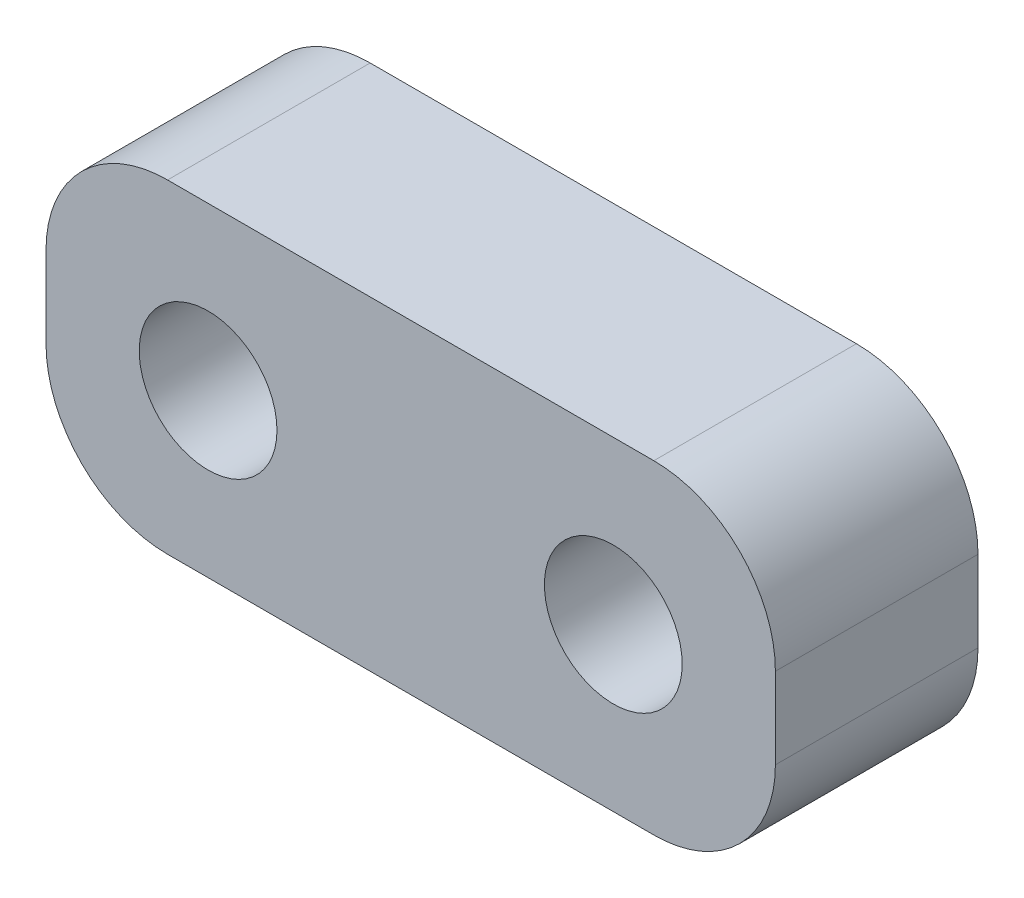
ISO-10303-21;
HEADER;
FILE_DESCRIPTION(('STEP AP214'),'2;1');
FILE_NAME('part.step','',(''),(''),'','','');
FILE_SCHEMA(('AUTOMOTIVE_DESIGN { 1 0 10303 214 1 1 1 1 }'));
ENDSEC;
DATA;
#1=APPLICATION_CONTEXT('core data for automotive mechanical design processes');
#2=APPLICATION_PROTOCOL_DEFINITION('international standard','automotive_design',2000,#1);
#3=PRODUCT_CONTEXT('',#1,'mechanical');
#4=PRODUCT('Part','Part','',(#3));
#5=PRODUCT_RELATED_PRODUCT_CATEGORY('part','',(#4));
#6=PRODUCT_DEFINITION_FORMATION('','',#4);
#7=PRODUCT_DEFINITION_CONTEXT('part definition',#1,'design');
#8=PRODUCT_DEFINITION('design','',#6,#7);
#9=PRODUCT_DEFINITION_SHAPE('','',#8);
#10=(LENGTH_UNIT() NAMED_UNIT(*) SI_UNIT(.MILLI.,.METRE.));
#11=(NAMED_UNIT(*) PLANE_ANGLE_UNIT() SI_UNIT($,.RADIAN.));
#12=(NAMED_UNIT(*) SI_UNIT($,.STERADIAN.) SOLID_ANGLE_UNIT());
#13=UNCERTAINTY_MEASURE_WITH_UNIT(LENGTH_MEASURE(1.E-05),#10,'distance_accuracy_value','');
#14=(GEOMETRIC_REPRESENTATION_CONTEXT(3) GLOBAL_UNCERTAINTY_ASSIGNED_CONTEXT((#13)) GLOBAL_UNIT_ASSIGNED_CONTEXT((#10,
#11,#12)) REPRESENTATION_CONTEXT('',''));
#15=CARTESIAN_POINT('',(0.,0.,0.));
#16=DIRECTION('',(0.,0.,1.));
#17=DIRECTION('',(1.,0.,0.));
#18=AXIS2_PLACEMENT_3D('',#15,#16,#17);
#19=CARTESIAN_POINT('',(9.00000000000001,4.,2.5));
#20=DIRECTION('',(-1.,0.,0.));
#21=DIRECTION('',(0.,-1.,0.));
#22=AXIS2_PLACEMENT_3D('',#19,#20,#21);
#23=PLANE('',#22);
#24=DIRECTION('',(0.,1.,0.));
#25=VECTOR('',#24,1.);
#26=CARTESIAN_POINT('',(9.00000000000001,4.,2.5));
#27=LINE('',#26,#25);
#28=CARTESIAN_POINT('',(9.,-1.,2.5));
#29=VERTEX_POINT('',#28);
#30=CARTESIAN_POINT('',(9.,0.999999999999998,2.5));
#31=VERTEX_POINT('',#30);
#32=EDGE_CURVE('E134',#29,#31,#27,.T.);
#33=ORIENTED_EDGE('',*,*,#32,.F.);
#34=DIRECTION('',(0.,0.,-1.));
#35=VECTOR('',#34,1.);
#36=CARTESIAN_POINT('',(9.,-1.,2.5));
#37=LINE('',#36,#35);
#38=CARTESIAN_POINT('',(9.,-1.,-2.5));
#39=VERTEX_POINT('',#38);
#40=EDGE_CURVE('E11',#29,#39,#37,.T.);
#41=ORIENTED_EDGE('',*,*,#40,.T.);
#42=DIRECTION('',(0.,1.,0.));
#43=VECTOR('',#42,1.);
#44=CARTESIAN_POINT('',(9.00000000000001,4.,-2.5));
#45=LINE('',#44,#43);
#46=CARTESIAN_POINT('',(9.,0.999999999999998,-2.5));
#47=VERTEX_POINT('',#46);
#48=EDGE_CURVE('E136',#39,#47,#45,.T.);
#49=ORIENTED_EDGE('',*,*,#48,.T.);
#50=DIRECTION('',(0.,0.,-1.));
#51=VECTOR('',#50,1.);
#52=CARTESIAN_POINT('',(9.,0.999999999999998,2.5));
#53=LINE('',#52,#51);
#54=EDGE_CURVE('E47',#47,#31,#53,.F.);
#55=ORIENTED_EDGE('',*,*,#54,.T.);
#56=EDGE_LOOP('',(#33,#41,#49,#55));
#57=FACE_BOUND('',#56,.T.);
#58=ADVANCED_FACE('F39',(#57),#23,.F.);
#59=CARTESIAN_POINT('',(-8.99999999999999,4.,2.5));
#60=DIRECTION('',(0.,-1.,0.));
#61=DIRECTION('',(0.,0.,-1.));
#62=AXIS2_PLACEMENT_3D('',#59,#60,#61);
#63=PLANE('',#62);
#64=DIRECTION('',(-1.,0.,0.));
#65=VECTOR('',#64,1.);
#66=CARTESIAN_POINT('',(-8.99999999999999,4.,-2.5));
#67=LINE('',#66,#65);
#68=CARTESIAN_POINT('',(6.,4.,-2.5));
#69=VERTEX_POINT('',#68);
#70=CARTESIAN_POINT('',(-5.99999999999999,4.,-2.5));
#71=VERTEX_POINT('',#70);
#72=EDGE_CURVE('E132',#69,#71,#67,.T.);
#73=ORIENTED_EDGE('',*,*,#72,.T.);
#74=DIRECTION('',(0.,0.,-1.));
#75=VECTOR('',#74,1.);
#76=CARTESIAN_POINT('',(-5.99999999999999,4.,2.5));
#77=LINE('',#76,#75);
#78=CARTESIAN_POINT('',(-5.99999999999999,4.,2.5));
#79=VERTEX_POINT('',#78);
#80=EDGE_CURVE('E111',#71,#79,#77,.F.);
#81=ORIENTED_EDGE('',*,*,#80,.T.);
#82=DIRECTION('',(-1.,0.,0.));
#83=VECTOR('',#82,1.);
#84=CARTESIAN_POINT('',(-8.99999999999999,4.,2.5));
#85=LINE('',#84,#83);
#86=CARTESIAN_POINT('',(6.,4.,2.5));
#87=VERTEX_POINT('',#86);
#88=EDGE_CURVE('E172',#87,#79,#85,.T.);
#89=ORIENTED_EDGE('',*,*,#88,.F.);
#90=DIRECTION('',(0.,0.,-1.));
#91=VECTOR('',#90,1.);
#92=CARTESIAN_POINT('',(6.,4.,2.5));
#93=LINE('',#92,#91);
#94=EDGE_CURVE('E116',#87,#69,#93,.T.);
#95=ORIENTED_EDGE('',*,*,#94,.T.);
#96=EDGE_LOOP('',(#73,#81,#89,#95));
#97=FACE_BOUND('',#96,.T.);
#98=ADVANCED_FACE('F176',(#97),#63,.F.);
#99=CARTESIAN_POINT('',(-8.99999999999999,4.,2.5));
#100=DIRECTION('',(1.,0.,0.));
#101=DIRECTION('',(0.,0.,-1.));
#102=AXIS2_PLACEMENT_3D('',#99,#100,#101);
#103=PLANE('',#102);
#104=DIRECTION('',(0.,-1.,0.));
#105=VECTOR('',#104,1.);
#106=CARTESIAN_POINT('',(-8.99999999999999,4.,2.5));
#107=LINE('',#106,#105);
#108=CARTESIAN_POINT('',(-8.99999999999999,0.999999999999999,2.5));
#109=VERTEX_POINT('',#108);
#110=CARTESIAN_POINT('',(-8.99999999999999,-1.,2.5));
#111=VERTEX_POINT('',#110);
#112=EDGE_CURVE('E125',#109,#111,#107,.T.);
#113=ORIENTED_EDGE('',*,*,#112,.F.);
#114=DIRECTION('',(0.,0.,-1.));
#115=VECTOR('',#114,1.);
#116=CARTESIAN_POINT('',(-8.99999999999999,0.999999999999999,2.5));
#117=LINE('',#116,#115);
#118=CARTESIAN_POINT('',(-8.99999999999999,0.999999999999999,-2.5));
#119=VERTEX_POINT('',#118);
#120=EDGE_CURVE('E110',#109,#119,#117,.T.);
#121=ORIENTED_EDGE('',*,*,#120,.T.);
#122=DIRECTION('',(0.,-1.,0.));
#123=VECTOR('',#122,1.);
#124=CARTESIAN_POINT('',(-8.99999999999999,4.,-2.5));
#125=LINE('',#124,#123);
#126=CARTESIAN_POINT('',(-8.99999999999999,-1.,-2.5));
#127=VERTEX_POINT('',#126);
#128=EDGE_CURVE('E123',#119,#127,#125,.T.);
#129=ORIENTED_EDGE('',*,*,#128,.T.);
#130=DIRECTION('',(0.,0.,-1.));
#131=VECTOR('',#130,1.);
#132=CARTESIAN_POINT('',(-8.99999999999999,-1.,2.5));
#133=LINE('',#132,#131);
#134=EDGE_CURVE('E127',#127,#111,#133,.F.);
#135=ORIENTED_EDGE('',*,*,#134,.T.);
#136=EDGE_LOOP('',(#113,#121,#129,#135));
#137=FACE_BOUND('',#136,.T.);
#138=ADVANCED_FACE('F122',(#137),#103,.F.);
#139=CARTESIAN_POINT('',(-8.99999999999999,-4.,2.5));
#140=DIRECTION('',(0.,1.,0.));
#141=DIRECTION('',(0.,0.,1.));
#142=AXIS2_PLACEMENT_3D('',#139,#140,#141);
#143=PLANE('',#142);
#144=DIRECTION('',(1.,0.,0.));
#145=VECTOR('',#144,1.);
#146=CARTESIAN_POINT('',(-8.99999999999999,-4.,2.5));
#147=LINE('',#146,#145);
#148=CARTESIAN_POINT('',(-5.99999999999999,-4.,2.5));
#149=VERTEX_POINT('',#148);
#150=CARTESIAN_POINT('',(6.,-4.,2.5));
#151=VERTEX_POINT('',#150);
#152=EDGE_CURVE('E140',#149,#151,#147,.T.);
#153=ORIENTED_EDGE('',*,*,#152,.F.);
#154=DIRECTION('',(0.,0.,-1.));
#155=VECTOR('',#154,1.);
#156=CARTESIAN_POINT('',(-5.99999999999999,-4.,2.5));
#157=LINE('',#156,#155);
#158=CARTESIAN_POINT('',(-5.99999999999999,-4.,-2.5));
#159=VERTEX_POINT('',#158);
#160=EDGE_CURVE('E157',#149,#159,#157,.T.);
#161=ORIENTED_EDGE('',*,*,#160,.T.);
#162=DIRECTION('',(1.,0.,0.));
#163=VECTOR('',#162,1.);
#164=CARTESIAN_POINT('',(-8.99999999999999,-4.,-2.5));
#165=LINE('',#164,#163);
#166=CARTESIAN_POINT('',(6.,-4.,-2.5));
#167=VERTEX_POINT('',#166);
#168=EDGE_CURVE('E131',#159,#167,#165,.T.);
#169=ORIENTED_EDGE('',*,*,#168,.T.);
#170=DIRECTION('',(0.,0.,-1.));
#171=VECTOR('',#170,1.);
#172=CARTESIAN_POINT('',(6.,-4.,2.5));
#173=LINE('',#172,#171);
#174=EDGE_CURVE('E54',#167,#151,#173,.F.);
#175=ORIENTED_EDGE('',*,*,#174,.T.);
#176=EDGE_LOOP('',(#153,#161,#169,#175));
#177=FACE_BOUND('',#176,.T.);
#178=ADVANCED_FACE('F198',(#177),#143,.F.);
#179=CARTESIAN_POINT('',(0.,0.,2.5));
#180=DIRECTION('',(0.,0.,1.));
#181=DIRECTION('',(1.,0.,0.));
#182=AXIS2_PLACEMENT_3D('',#179,#180,#181);
#183=PLANE('',#182);
#184=CARTESIAN_POINT('',(-5.,0.,2.5));
#185=DIRECTION('',(0.,0.,1.));
#186=DIRECTION('',(1.,0.,0.));
#187=AXIS2_PLACEMENT_3D('',#184,#185,#186);
#188=CIRCLE('',#187,1.69999999999999);
#189=CARTESIAN_POINT('',(-3.30000000000001,0.,2.5));
#190=VERTEX_POINT('',#189);
#191=EDGE_CURVE('E190',#190,#190,#188,.T.);
#192=ORIENTED_EDGE('',*,*,#191,.F.);
#193=EDGE_LOOP('',(#192));
#194=FACE_BOUND('',#193,.T.);
#195=CARTESIAN_POINT('',(5.,0.,2.5));
#196=DIRECTION('',(0.,0.,1.));
#197=DIRECTION('',(1.,0.,0.));
#198=AXIS2_PLACEMENT_3D('',#195,#196,#197);
#199=CIRCLE('',#198,1.69999999999999);
#200=CARTESIAN_POINT('',(6.69999999999999,0.,2.5));
#201=VERTEX_POINT('',#200);
#202=EDGE_CURVE('E179',#201,#201,#199,.T.);
#203=ORIENTED_EDGE('',*,*,#202,.F.);
#204=EDGE_LOOP('',(#203));
#205=FACE_BOUND('',#204,.T.);
#206=ORIENTED_EDGE('',*,*,#88,.T.);
#207=CARTESIAN_POINT('',(-5.99999999999999,0.999999999999999,2.5));
#208=DIRECTION('',(0.,0.,1.));
#209=DIRECTION('',(1.,0.,0.));
#210=AXIS2_PLACEMENT_3D('',#207,#208,#209);
#211=CIRCLE('',#210,3.);
#212=EDGE_CURVE('E154',#79,#109,#211,.T.);
#213=ORIENTED_EDGE('',*,*,#212,.T.);
#214=ORIENTED_EDGE('',*,*,#112,.T.);
#215=CARTESIAN_POINT('',(-5.99999999999999,-1.,2.5));
#216=DIRECTION('',(0.,0.,1.));
#217=DIRECTION('',(1.,0.,0.));
#218=AXIS2_PLACEMENT_3D('',#215,#216,#217);
#219=CIRCLE('',#218,3.);
#220=EDGE_CURVE('E61',#111,#149,#219,.T.);
#221=ORIENTED_EDGE('',*,*,#220,.T.);
#222=ORIENTED_EDGE('',*,*,#152,.T.);
#223=CARTESIAN_POINT('',(6.,-1.,2.5));
#224=DIRECTION('',(0.,0.,1.));
#225=DIRECTION('',(1.,0.,0.));
#226=AXIS2_PLACEMENT_3D('',#223,#224,#225);
#227=CIRCLE('',#226,3.);
#228=EDGE_CURVE('E151',#151,#29,#227,.T.);
#229=ORIENTED_EDGE('',*,*,#228,.T.);
#230=ORIENTED_EDGE('',*,*,#32,.T.);
#231=CARTESIAN_POINT('',(6.,0.999999999999999,2.5));
#232=DIRECTION('',(0.,0.,1.));
#233=DIRECTION('',(1.,0.,0.));
#234=AXIS2_PLACEMENT_3D('',#231,#232,#233);
#235=CIRCLE('',#234,3.);
#236=EDGE_CURVE('E149',#31,#87,#235,.T.);
#237=ORIENTED_EDGE('',*,*,#236,.T.);
#238=EDGE_LOOP('',(#206,#213,#214,#221,#222,#229,#230,#237));
#239=FACE_BOUND('',#238,.T.);
#240=ADVANCED_FACE('F169',(#194,#205,#239),#183,.T.);
#241=CARTESIAN_POINT('',(0.,0.,-2.5));
#242=DIRECTION('',(0.,0.,1.));
#243=DIRECTION('',(1.,0.,0.));
#244=AXIS2_PLACEMENT_3D('',#241,#242,#243);
#245=PLANE('',#244);
#246=CARTESIAN_POINT('',(-5.,0.,-2.5));
#247=DIRECTION('',(0.,0.,1.));
#248=DIRECTION('',(1.,0.,0.));
#249=AXIS2_PLACEMENT_3D('',#246,#247,#248);
#250=CIRCLE('',#249,1.7);
#251=CARTESIAN_POINT('',(-3.30000000000001,0.,-2.5));
#252=VERTEX_POINT('',#251);
#253=EDGE_CURVE('E187',#252,#252,#250,.T.);
#254=ORIENTED_EDGE('',*,*,#253,.T.);
#255=EDGE_LOOP('',(#254));
#256=FACE_BOUND('',#255,.T.);
#257=CARTESIAN_POINT('',(5.,0.,-2.5));
#258=DIRECTION('',(0.,0.,1.));
#259=DIRECTION('',(1.,0.,0.));
#260=AXIS2_PLACEMENT_3D('',#257,#258,#259);
#261=CIRCLE('',#260,1.7);
#262=CARTESIAN_POINT('',(6.69999999999999,0.,-2.5));
#263=VERTEX_POINT('',#262);
#264=EDGE_CURVE('E177',#263,#263,#261,.T.);
#265=ORIENTED_EDGE('',*,*,#264,.T.);
#266=EDGE_LOOP('',(#265));
#267=FACE_BOUND('',#266,.T.);
#268=ORIENTED_EDGE('',*,*,#128,.F.);
#269=CARTESIAN_POINT('',(-5.99999999999999,0.999999999999999,-2.5));
#270=DIRECTION('',(0.,0.,1.));
#271=DIRECTION('',(1.,0.,0.));
#272=AXIS2_PLACEMENT_3D('',#269,#270,#271);
#273=CIRCLE('',#272,3.);
#274=EDGE_CURVE('E106',#119,#71,#273,.F.);
#275=ORIENTED_EDGE('',*,*,#274,.T.);
#276=ORIENTED_EDGE('',*,*,#72,.F.);
#277=CARTESIAN_POINT('',(6.,0.999999999999999,-2.5));
#278=DIRECTION('',(0.,0.,1.));
#279=DIRECTION('',(1.,0.,0.));
#280=AXIS2_PLACEMENT_3D('',#277,#278,#279);
#281=CIRCLE('',#280,3.);
#282=EDGE_CURVE('E126',#69,#47,#281,.F.);
#283=ORIENTED_EDGE('',*,*,#282,.T.);
#284=ORIENTED_EDGE('',*,*,#48,.F.);
#285=CARTESIAN_POINT('',(6.,-1.,-2.5));
#286=DIRECTION('',(0.,0.,1.));
#287=DIRECTION('',(1.,0.,0.));
#288=AXIS2_PLACEMENT_3D('',#285,#286,#287);
#289=CIRCLE('',#288,3.);
#290=EDGE_CURVE('E143',#39,#167,#289,.F.);
#291=ORIENTED_EDGE('',*,*,#290,.T.);
#292=ORIENTED_EDGE('',*,*,#168,.F.);
#293=CARTESIAN_POINT('',(-5.99999999999999,-1.,-2.5));
#294=DIRECTION('',(0.,0.,1.));
#295=DIRECTION('',(1.,0.,0.));
#296=AXIS2_PLACEMENT_3D('',#293,#294,#295);
#297=CIRCLE('',#296,3.);
#298=EDGE_CURVE('E117',#159,#127,#297,.F.);
#299=ORIENTED_EDGE('',*,*,#298,.T.);
#300=EDGE_LOOP('',(#268,#275,#276,#283,#284,#291,#292,#299));
#301=FACE_BOUND('',#300,.T.);
#302=ADVANCED_FACE('F129',(#256,#267,#301),#245,.F.);
#303=CARTESIAN_POINT('',(5.,0.,2.5));
#304=DIRECTION('',(0.,0.,1.));
#305=DIRECTION('',(1.,0.,0.));
#306=AXIS2_PLACEMENT_3D('',#303,#304,#305);
#307=CYLINDRICAL_SURFACE('',#306,1.69999999999999);
#308=ORIENTED_EDGE('',*,*,#264,.F.);
#309=EDGE_LOOP('',(#308));
#310=FACE_BOUND('',#309,.T.);
#311=ORIENTED_EDGE('',*,*,#202,.T.);
#312=EDGE_LOOP('',(#311));
#313=FACE_BOUND('',#312,.T.);
#314=ADVANCED_FACE('F202',(#310,#313),#307,.F.);
#315=CARTESIAN_POINT('',(-5.,0.,2.5));
#316=DIRECTION('',(0.,0.,1.));
#317=DIRECTION('',(1.,0.,0.));
#318=AXIS2_PLACEMENT_3D('',#315,#316,#317);
#319=CYLINDRICAL_SURFACE('',#318,1.69999999999999);
#320=ORIENTED_EDGE('',*,*,#253,.F.);
#321=EDGE_LOOP('',(#320));
#322=FACE_BOUND('',#321,.T.);
#323=ORIENTED_EDGE('',*,*,#191,.T.);
#324=EDGE_LOOP('',(#323));
#325=FACE_BOUND('',#324,.T.);
#326=ADVANCED_FACE('F194',(#322,#325),#319,.F.);
#327=CARTESIAN_POINT('',(-5.99999999999999,0.999999999999999,2.5));
#328=DIRECTION('',(0.,0.,-1.));
#329=DIRECTION('',(-1.,0.,0.));
#330=AXIS2_PLACEMENT_3D('',#327,#328,#329);
#331=CYLINDRICAL_SURFACE('',#330,3.);
#332=ORIENTED_EDGE('',*,*,#212,.F.);
#333=ORIENTED_EDGE('',*,*,#80,.F.);
#334=ORIENTED_EDGE('',*,*,#274,.F.);
#335=ORIENTED_EDGE('',*,*,#120,.F.);
#336=EDGE_LOOP('',(#332,#333,#334,#335));
#337=FACE_BOUND('',#336,.T.);
#338=ADVANCED_FACE('F109',(#337),#331,.T.);
#339=CARTESIAN_POINT('',(-5.99999999999999,-1.,2.5));
#340=DIRECTION('',(0.,0.,-1.));
#341=DIRECTION('',(-1.,0.,0.));
#342=AXIS2_PLACEMENT_3D('',#339,#340,#341);
#343=CYLINDRICAL_SURFACE('',#342,3.);
#344=ORIENTED_EDGE('',*,*,#220,.F.);
#345=ORIENTED_EDGE('',*,*,#134,.F.);
#346=ORIENTED_EDGE('',*,*,#298,.F.);
#347=ORIENTED_EDGE('',*,*,#160,.F.);
#348=EDGE_LOOP('',(#344,#345,#346,#347));
#349=FACE_BOUND('',#348,.T.);
#350=ADVANCED_FACE('F225',(#349),#343,.T.);
#351=CARTESIAN_POINT('',(6.,-1.,2.5));
#352=DIRECTION('',(0.,0.,-1.));
#353=DIRECTION('',(-1.,0.,0.));
#354=AXIS2_PLACEMENT_3D('',#351,#352,#353);
#355=CYLINDRICAL_SURFACE('',#354,3.);
#356=ORIENTED_EDGE('',*,*,#228,.F.);
#357=ORIENTED_EDGE('',*,*,#174,.F.);
#358=ORIENTED_EDGE('',*,*,#290,.F.);
#359=ORIENTED_EDGE('',*,*,#40,.F.);
#360=EDGE_LOOP('',(#356,#357,#358,#359));
#361=FACE_BOUND('',#360,.T.);
#362=ADVANCED_FACE('F227',(#361),#355,.T.);
#363=CARTESIAN_POINT('',(6.,0.999999999999999,2.5));
#364=DIRECTION('',(0.,0.,-1.));
#365=DIRECTION('',(-1.,0.,0.));
#366=AXIS2_PLACEMENT_3D('',#363,#364,#365);
#367=CYLINDRICAL_SURFACE('',#366,3.);
#368=ORIENTED_EDGE('',*,*,#236,.F.);
#369=ORIENTED_EDGE('',*,*,#54,.F.);
#370=ORIENTED_EDGE('',*,*,#282,.F.);
#371=ORIENTED_EDGE('',*,*,#94,.F.);
#372=EDGE_LOOP('',(#368,#369,#370,#371));
#373=FACE_BOUND('',#372,.T.);
#374=ADVANCED_FACE('F41',(#373),#367,.T.);
#375=CLOSED_SHELL('',(#58,#98,#138,#178,#240,#302,#314,#326,#338,#350,#362,#374));
#376=MANIFOLD_SOLID_BREP('B2',#375);
#377=ADVANCED_BREP_SHAPE_REPRESENTATION('',(#18,#376),#14);
#378=SHAPE_DEFINITION_REPRESENTATION(#9,#377);
ENDSEC;
END-ISO-10303-21;
